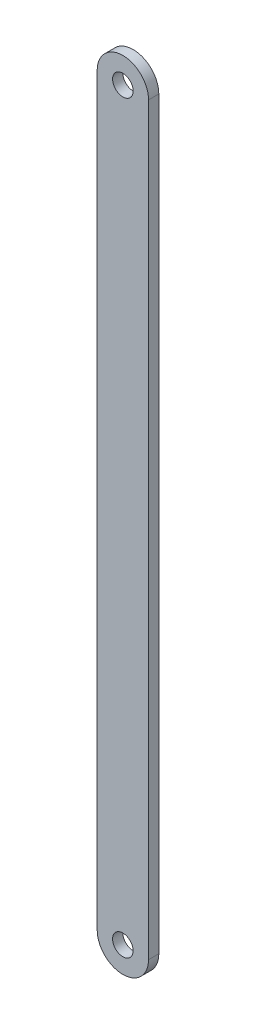
ISO-10303-21;
HEADER;
FILE_DESCRIPTION(('STEP AP214'),'2;1');
FILE_NAME('part.step','',(''),(''),'','','');
FILE_SCHEMA(('AUTOMOTIVE_DESIGN { 1 0 10303 214 1 1 1 1 }'));
ENDSEC;
DATA;
#1=APPLICATION_CONTEXT('core data for automotive mechanical design processes');
#2=APPLICATION_PROTOCOL_DEFINITION('international standard','automotive_design',2000,#1);
#3=PRODUCT_CONTEXT('',#1,'mechanical');
#4=PRODUCT('Part','Part','',(#3));
#5=PRODUCT_RELATED_PRODUCT_CATEGORY('part','',(#4));
#6=PRODUCT_DEFINITION_FORMATION('','',#4);
#7=PRODUCT_DEFINITION_CONTEXT('part definition',#1,'design');
#8=PRODUCT_DEFINITION('design','',#6,#7);
#9=PRODUCT_DEFINITION_SHAPE('','',#8);
#10=(LENGTH_UNIT() NAMED_UNIT(*) SI_UNIT(.MILLI.,.METRE.));
#11=(NAMED_UNIT(*) PLANE_ANGLE_UNIT() SI_UNIT($,.RADIAN.));
#12=(NAMED_UNIT(*) SI_UNIT($,.STERADIAN.) SOLID_ANGLE_UNIT());
#13=UNCERTAINTY_MEASURE_WITH_UNIT(LENGTH_MEASURE(1.E-05),#10,'distance_accuracy_value','');
#14=(GEOMETRIC_REPRESENTATION_CONTEXT(3) GLOBAL_UNCERTAINTY_ASSIGNED_CONTEXT((#13)) GLOBAL_UNIT_ASSIGNED_CONTEXT((#10,
#11,#12)) REPRESENTATION_CONTEXT('',''));
#15=CARTESIAN_POINT('',(0.,0.,0.));
#16=DIRECTION('',(0.,0.,1.));
#17=DIRECTION('',(1.,0.,0.));
#18=AXIS2_PLACEMENT_3D('',#15,#16,#17);
#19=CARTESIAN_POINT('',(0.,-72.5,2.));
#20=DIRECTION('',(0.,0.,1.));
#21=DIRECTION('',(1.,0.,0.));
#22=AXIS2_PLACEMENT_3D('',#19,#20,#21);
#23=PLANE('',#22);
#24=CARTESIAN_POINT('',(0.,72.5,2.));
#25=DIRECTION('',(0.,0.,1.));
#26=DIRECTION('',(1.,0.,0.));
#27=AXIS2_PLACEMENT_3D('',#24,#25,#26);
#28=CIRCLE('',#27,2.);
#29=CARTESIAN_POINT('',(1.99999999999997,72.5,2.));
#30=VERTEX_POINT('',#29);
#31=EDGE_CURVE('E86',#30,#30,#28,.T.);
#32=ORIENTED_EDGE('',*,*,#31,.F.);
#33=EDGE_LOOP('',(#32));
#34=FACE_BOUND('',#33,.T.);
#35=CARTESIAN_POINT('',(0.,-72.5,2.));
#36=DIRECTION('',(0.,0.,1.));
#37=DIRECTION('',(1.,0.,0.));
#38=AXIS2_PLACEMENT_3D('',#35,#36,#37);
#39=CIRCLE('',#38,5.);
#40=CARTESIAN_POINT('',(-5.,-72.5,2.));
#41=VERTEX_POINT('',#40);
#42=CARTESIAN_POINT('',(5.,-72.5,2.));
#43=VERTEX_POINT('',#42);
#44=EDGE_CURVE('E71',#41,#43,#39,.T.);
#45=ORIENTED_EDGE('',*,*,#44,.T.);
#46=DIRECTION('',(0.,1.,0.));
#47=VECTOR('',#46,1.);
#48=CARTESIAN_POINT('',(5.,-72.5,2.));
#49=LINE('',#48,#47);
#50=CARTESIAN_POINT('',(5.,72.5,2.));
#51=VERTEX_POINT('',#50);
#52=EDGE_CURVE('E66',#43,#51,#49,.T.);
#53=ORIENTED_EDGE('',*,*,#52,.T.);
#54=CARTESIAN_POINT('',(0.,72.5,2.));
#55=DIRECTION('',(0.,0.,1.));
#56=DIRECTION('',(1.,0.,0.));
#57=AXIS2_PLACEMENT_3D('',#54,#55,#56);
#58=CIRCLE('',#57,5.);
#59=CARTESIAN_POINT('',(-5.00000000000006,72.5,2.));
#60=VERTEX_POINT('',#59);
#61=EDGE_CURVE('E69',#51,#60,#58,.T.);
#62=ORIENTED_EDGE('',*,*,#61,.T.);
#63=DIRECTION('',(0.,-1.,0.));
#64=VECTOR('',#63,1.);
#65=CARTESIAN_POINT('',(-5.,-72.5,2.));
#66=LINE('',#65,#64);
#67=EDGE_CURVE('E36',#60,#41,#66,.T.);
#68=ORIENTED_EDGE('',*,*,#67,.T.);
#69=EDGE_LOOP('',(#45,#53,#62,#68));
#70=FACE_BOUND('',#69,.T.);
#71=CARTESIAN_POINT('',(0.,-72.5,2.));
#72=DIRECTION('',(0.,0.,1.));
#73=DIRECTION('',(1.,0.,0.));
#74=AXIS2_PLACEMENT_3D('',#71,#72,#73);
#75=CIRCLE('',#74,2.);
#76=CARTESIAN_POINT('',(2.00000000000003,-72.5,2.));
#77=VERTEX_POINT('',#76);
#78=EDGE_CURVE('E101',#77,#77,#75,.T.);
#79=ORIENTED_EDGE('',*,*,#78,.F.);
#80=EDGE_LOOP('',(#79));
#81=FACE_BOUND('',#80,.T.);
#82=ADVANCED_FACE('F19',(#34,#70,#81),#23,.T.);
#83=CARTESIAN_POINT('',(0.,-72.5,0.));
#84=DIRECTION('',(0.,0.,1.));
#85=DIRECTION('',(1.,0.,0.));
#86=AXIS2_PLACEMENT_3D('',#83,#84,#85);
#87=PLANE('',#86);
#88=CARTESIAN_POINT('',(0.,72.5,0.));
#89=DIRECTION('',(0.,0.,1.));
#90=DIRECTION('',(1.,0.,0.));
#91=AXIS2_PLACEMENT_3D('',#88,#89,#90);
#92=CIRCLE('',#91,2.);
#93=CARTESIAN_POINT('',(1.99999999999997,72.5,0.));
#94=VERTEX_POINT('',#93);
#95=EDGE_CURVE('E98',#94,#94,#92,.T.);
#96=ORIENTED_EDGE('',*,*,#95,.T.);
#97=EDGE_LOOP('',(#96));
#98=FACE_BOUND('',#97,.T.);
#99=CARTESIAN_POINT('',(0.,-72.5,0.));
#100=DIRECTION('',(0.,0.,1.));
#101=DIRECTION('',(1.,0.,0.));
#102=AXIS2_PLACEMENT_3D('',#99,#100,#101);
#103=CIRCLE('',#102,5.);
#104=CARTESIAN_POINT('',(-5.,-72.5,0.));
#105=VERTEX_POINT('',#104);
#106=CARTESIAN_POINT('',(5.,-72.5,0.));
#107=VERTEX_POINT('',#106);
#108=EDGE_CURVE('E83',#105,#107,#103,.T.);
#109=ORIENTED_EDGE('',*,*,#108,.F.);
#110=DIRECTION('',(0.,-1.,0.));
#111=VECTOR('',#110,1.);
#112=CARTESIAN_POINT('',(-5.,-72.5,0.));
#113=LINE('',#112,#111);
#114=CARTESIAN_POINT('',(-5.00000000000006,72.5,0.));
#115=VERTEX_POINT('',#114);
#116=EDGE_CURVE('E59',#115,#105,#113,.T.);
#117=ORIENTED_EDGE('',*,*,#116,.F.);
#118=CARTESIAN_POINT('',(0.,72.5,0.));
#119=DIRECTION('',(0.,0.,1.));
#120=DIRECTION('',(1.,0.,0.));
#121=AXIS2_PLACEMENT_3D('',#118,#119,#120);
#122=CIRCLE('',#121,5.);
#123=CARTESIAN_POINT('',(5.,72.5,0.));
#124=VERTEX_POINT('',#123);
#125=EDGE_CURVE('E53',#124,#115,#122,.T.);
#126=ORIENTED_EDGE('',*,*,#125,.F.);
#127=DIRECTION('',(0.,1.,0.));
#128=VECTOR('',#127,1.);
#129=CARTESIAN_POINT('',(5.,-72.5,0.));
#130=LINE('',#129,#128);
#131=EDGE_CURVE('E75',#107,#124,#130,.T.);
#132=ORIENTED_EDGE('',*,*,#131,.F.);
#133=EDGE_LOOP('',(#109,#117,#126,#132));
#134=FACE_BOUND('',#133,.T.);
#135=CARTESIAN_POINT('',(0.,-72.5,0.));
#136=DIRECTION('',(0.,0.,1.));
#137=DIRECTION('',(1.,0.,0.));
#138=AXIS2_PLACEMENT_3D('',#135,#136,#137);
#139=CIRCLE('',#138,2.);
#140=CARTESIAN_POINT('',(2.00000000000003,-72.5,0.));
#141=VERTEX_POINT('',#140);
#142=EDGE_CURVE('E104',#141,#141,#139,.T.);
#143=ORIENTED_EDGE('',*,*,#142,.T.);
#144=EDGE_LOOP('',(#143));
#145=FACE_BOUND('',#144,.T.);
#146=ADVANCED_FACE('F94',(#98,#134,#145),#87,.F.);
#147=CARTESIAN_POINT('',(0.,-72.5,2.));
#148=DIRECTION('',(0.,0.,-1.));
#149=DIRECTION('',(-1.,0.,0.));
#150=AXIS2_PLACEMENT_3D('',#147,#148,#149);
#151=CYLINDRICAL_SURFACE('',#150,5.);
#152=ORIENTED_EDGE('',*,*,#108,.T.);
#153=DIRECTION('',(0.,0.,-1.));
#154=VECTOR('',#153,1.);
#155=CARTESIAN_POINT('',(5.,-72.5,2.));
#156=LINE('',#155,#154);
#157=EDGE_CURVE('E11',#43,#107,#156,.T.);
#158=ORIENTED_EDGE('',*,*,#157,.F.);
#159=ORIENTED_EDGE('',*,*,#44,.F.);
#160=DIRECTION('',(0.,0.,-1.));
#161=VECTOR('',#160,1.);
#162=CARTESIAN_POINT('',(-5.,-72.5,2.));
#163=LINE('',#162,#161);
#164=EDGE_CURVE('E79',#41,#105,#163,.T.);
#165=ORIENTED_EDGE('',*,*,#164,.T.);
#166=EDGE_LOOP('',(#152,#158,#159,#165));
#167=FACE_BOUND('',#166,.T.);
#168=ADVANCED_FACE('F21',(#167),#151,.T.);
#169=CARTESIAN_POINT('',(5.,-72.5,2.));
#170=DIRECTION('',(-1.,0.,0.));
#171=DIRECTION('',(0.,-1.,0.));
#172=AXIS2_PLACEMENT_3D('',#169,#170,#171);
#173=PLANE('',#172);
#174=ORIENTED_EDGE('',*,*,#131,.T.);
#175=DIRECTION('',(0.,0.,-1.));
#176=VECTOR('',#175,1.);
#177=CARTESIAN_POINT('',(5.,72.5,2.));
#178=LINE('',#177,#176);
#179=EDGE_CURVE('E28',#51,#124,#178,.T.);
#180=ORIENTED_EDGE('',*,*,#179,.F.);
#181=ORIENTED_EDGE('',*,*,#52,.F.);
#182=ORIENTED_EDGE('',*,*,#157,.T.);
#183=EDGE_LOOP('',(#174,#180,#181,#182));
#184=FACE_BOUND('',#183,.T.);
#185=ADVANCED_FACE('F74',(#184),#173,.F.);
#186=CARTESIAN_POINT('',(0.,72.5,2.));
#187=DIRECTION('',(0.,0.,-1.));
#188=DIRECTION('',(-1.,0.,0.));
#189=AXIS2_PLACEMENT_3D('',#186,#187,#188);
#190=CYLINDRICAL_SURFACE('',#189,5.);
#191=ORIENTED_EDGE('',*,*,#125,.T.);
#192=DIRECTION('',(0.,0.,-1.));
#193=VECTOR('',#192,1.);
#194=CARTESIAN_POINT('',(-5.00000000000006,72.5,2.));
#195=LINE('',#194,#193);
#196=EDGE_CURVE('E76',#60,#115,#195,.T.);
#197=ORIENTED_EDGE('',*,*,#196,.F.);
#198=ORIENTED_EDGE('',*,*,#61,.F.);
#199=ORIENTED_EDGE('',*,*,#179,.T.);
#200=EDGE_LOOP('',(#191,#197,#198,#199));
#201=FACE_BOUND('',#200,.T.);
#202=ADVANCED_FACE('F77',(#201),#190,.T.);
#203=CARTESIAN_POINT('',(-5.,-72.5,2.));
#204=DIRECTION('',(1.,0.,0.));
#205=DIRECTION('',(0.,1.,0.));
#206=AXIS2_PLACEMENT_3D('',#203,#204,#205);
#207=PLANE('',#206);
#208=ORIENTED_EDGE('',*,*,#116,.T.);
#209=ORIENTED_EDGE('',*,*,#164,.F.);
#210=ORIENTED_EDGE('',*,*,#67,.F.);
#211=ORIENTED_EDGE('',*,*,#196,.T.);
#212=EDGE_LOOP('',(#208,#209,#210,#211));
#213=FACE_BOUND('',#212,.T.);
#214=ADVANCED_FACE('F91',(#213),#207,.F.);
#215=CARTESIAN_POINT('',(0.,72.5,2.));
#216=DIRECTION('',(0.,0.,-1.));
#217=DIRECTION('',(-1.,0.,0.));
#218=AXIS2_PLACEMENT_3D('',#215,#216,#217);
#219=CYLINDRICAL_SURFACE('',#218,2.);
#220=ORIENTED_EDGE('',*,*,#31,.T.);
#221=EDGE_LOOP('',(#220));
#222=FACE_BOUND('',#221,.T.);
#223=ORIENTED_EDGE('',*,*,#95,.F.);
#224=EDGE_LOOP('',(#223));
#225=FACE_BOUND('',#224,.T.);
#226=ADVANCED_FACE('F124',(#222,#225),#219,.F.);
#227=CARTESIAN_POINT('',(0.,-72.5,2.));
#228=DIRECTION('',(0.,0.,-1.));
#229=DIRECTION('',(-1.,0.,0.));
#230=AXIS2_PLACEMENT_3D('',#227,#228,#229);
#231=CYLINDRICAL_SURFACE('',#230,2.);
#232=ORIENTED_EDGE('',*,*,#78,.T.);
#233=EDGE_LOOP('',(#232));
#234=FACE_BOUND('',#233,.T.);
#235=ORIENTED_EDGE('',*,*,#142,.F.);
#236=EDGE_LOOP('',(#235));
#237=FACE_BOUND('',#236,.T.);
#238=ADVANCED_FACE('F110',(#234,#237),#231,.F.);
#239=CLOSED_SHELL('',(#82,#146,#168,#185,#202,#214,#226,#238));
#240=MANIFOLD_SOLID_BREP('B1',#239);
#241=ADVANCED_BREP_SHAPE_REPRESENTATION('',(#18,#240),#14);
#242=SHAPE_DEFINITION_REPRESENTATION(#9,#241);
ENDSEC;
END-ISO-10303-21;
